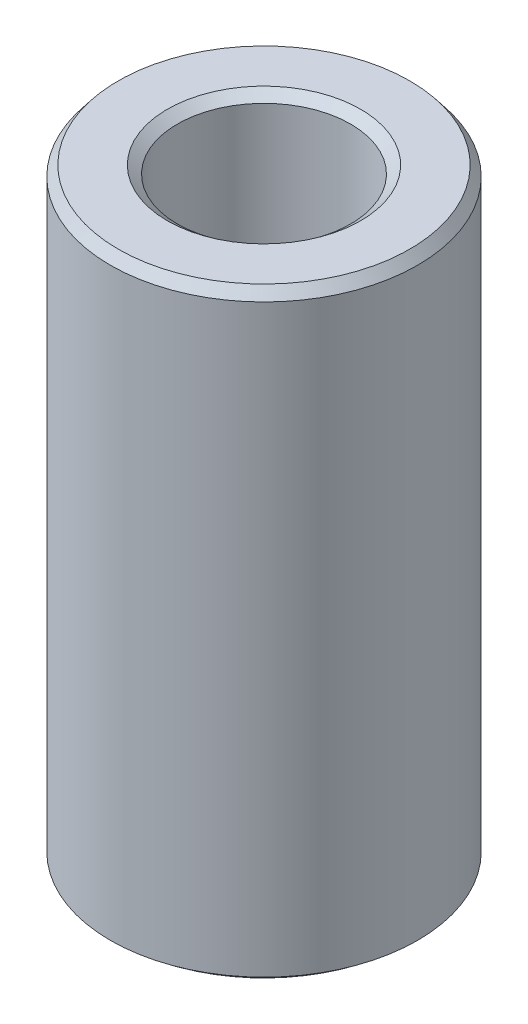
ISO-10303-21;
HEADER;
FILE_DESCRIPTION(('STEP AP214'),'2;1');
FILE_NAME('part.step','',(''),(''),'','','');
FILE_SCHEMA(('AUTOMOTIVE_DESIGN { 1 0 10303 214 1 1 1 1 }'));
ENDSEC;
DATA;
#1=APPLICATION_CONTEXT('core data for automotive mechanical design processes');
#2=APPLICATION_PROTOCOL_DEFINITION('international standard','automotive_design',2000,#1);
#3=PRODUCT_CONTEXT('',#1,'mechanical');
#4=PRODUCT('Part','Part','',(#3));
#5=PRODUCT_RELATED_PRODUCT_CATEGORY('part','',(#4));
#6=PRODUCT_DEFINITION_FORMATION('','',#4);
#7=PRODUCT_DEFINITION_CONTEXT('part definition',#1,'design');
#8=PRODUCT_DEFINITION('design','',#6,#7);
#9=PRODUCT_DEFINITION_SHAPE('','',#8);
#10=(LENGTH_UNIT() NAMED_UNIT(*) SI_UNIT(.MILLI.,.METRE.));
#11=(NAMED_UNIT(*) PLANE_ANGLE_UNIT() SI_UNIT($,.RADIAN.));
#12=(NAMED_UNIT(*) SI_UNIT($,.STERADIAN.) SOLID_ANGLE_UNIT());
#13=UNCERTAINTY_MEASURE_WITH_UNIT(LENGTH_MEASURE(1.E-05),#10,'distance_accuracy_value','');
#14=(GEOMETRIC_REPRESENTATION_CONTEXT(3) GLOBAL_UNCERTAINTY_ASSIGNED_CONTEXT((#13)) GLOBAL_UNIT_ASSIGNED_CONTEXT((#10,
#11,#12)) REPRESENTATION_CONTEXT('',''));
#15=CARTESIAN_POINT('',(0.,0.,0.));
#16=DIRECTION('',(0.,0.,1.));
#17=DIRECTION('',(1.,0.,0.));
#18=AXIS2_PLACEMENT_3D('',#15,#16,#17);
#19=CARTESIAN_POINT('',(0.,215.765966177956,0.));
#20=DIRECTION('',(0.,-1.,0.));
#21=DIRECTION('',(0.,0.,-1.));
#22=AXIS2_PLACEMENT_3D('',#19,#20,#21);
#23=CYLINDRICAL_SURFACE('',#22,55.);
#24=CARTESIAN_POINT('',(0.,2.80006320774273,0.));
#25=DIRECTION('',(0.,1.,0.));
#26=DIRECTION('',(0.,0.,1.));
#27=AXIS2_PLACEMENT_3D('',#24,#25,#26);
#28=CIRCLE('',#27,55.);
#29=CARTESIAN_POINT('',(0.,2.80006320774273,55.));
#30=VERTEX_POINT('',#29);
#31=EDGE_CURVE('E10',#30,#30,#28,.T.);
#32=ORIENTED_EDGE('',*,*,#31,.T.);
#33=EDGE_LOOP('',(#32));
#34=FACE_BOUND('',#33,.T.);
#35=CARTESIAN_POINT('',(0.,212.176720001309,0.));
#36=DIRECTION('',(0.,1.,0.));
#37=DIRECTION('',(0.,0.,1.));
#38=AXIS2_PLACEMENT_3D('',#35,#36,#37);
#39=CIRCLE('',#38,55.);
#40=CARTESIAN_POINT('',(0.,212.176720001309,55.));
#41=VERTEX_POINT('',#40);
#42=EDGE_CURVE('E50',#41,#41,#39,.F.);
#43=ORIENTED_EDGE('',*,*,#42,.T.);
#44=EDGE_LOOP('',(#43));
#45=FACE_BOUND('',#44,.T.);
#46=ADVANCED_FACE('F39',(#34,#45),#23,.T.);
#47=CARTESIAN_POINT('',(0.,215.765966177956,0.));
#48=DIRECTION('',(0.,1.,0.));
#49=DIRECTION('',(0.,0.,1.));
#50=AXIS2_PLACEMENT_3D('',#47,#48,#49);
#51=PLANE('',#50);
#52=CARTESIAN_POINT('',(0.,215.765966177956,0.));
#53=DIRECTION('',(0.,1.,0.));
#54=DIRECTION('',(0.,0.,1.));
#55=AXIS2_PLACEMENT_3D('',#52,#53,#54);
#56=CIRCLE('',#55,34.6072791589705);
#57=CARTESIAN_POINT('',(0.,215.765966177956,34.6072791589705));
#58=VERTEX_POINT('',#57);
#59=EDGE_CURVE('E58',#58,#58,#56,.F.);
#60=ORIENTED_EDGE('',*,*,#59,.T.);
#61=EDGE_LOOP('',(#60));
#62=FACE_BOUND('',#61,.T.);
#63=CARTESIAN_POINT('',(0.,215.765966177956,0.));
#64=DIRECTION('',(0.,1.,0.));
#65=DIRECTION('',(0.,0.,1.));
#66=AXIS2_PLACEMENT_3D('',#63,#64,#65);
#67=CIRCLE('',#66,52.1999367922572);
#68=CARTESIAN_POINT('',(0.,215.765966177956,52.1999367922572));
#69=VERTEX_POINT('',#68);
#70=EDGE_CURVE('E61',#69,#69,#67,.T.);
#71=ORIENTED_EDGE('',*,*,#70,.T.);
#72=EDGE_LOOP('',(#71));
#73=FACE_BOUND('',#72,.T.);
#74=ADVANCED_FACE('F88',(#62,#73),#51,.T.);
#75=CARTESIAN_POINT('',(0.,0.,0.));
#76=DIRECTION('',(0.,1.,0.));
#77=DIRECTION('',(0.,0.,1.));
#78=AXIS2_PLACEMENT_3D('',#75,#76,#77);
#79=PLANE('',#78);
#80=CARTESIAN_POINT('',(0.,0.,0.));
#81=DIRECTION('',(0.,1.,0.));
#82=DIRECTION('',(0.,0.,1.));
#83=AXIS2_PLACEMENT_3D('',#80,#81,#82);
#84=CIRCLE('',#83,33.8180961900667);
#85=CARTESIAN_POINT('',(0.,0.,-33.8180961900667));
#86=VERTEX_POINT('',#85);
#87=EDGE_CURVE('E51',#86,#86,#84,.T.);
#88=ORIENTED_EDGE('',*,*,#87,.T.);
#89=EDGE_LOOP('',(#88));
#90=FACE_BOUND('',#89,.T.);
#91=CARTESIAN_POINT('',(0.,0.,0.));
#92=DIRECTION('',(0.,1.,0.));
#93=DIRECTION('',(0.,0.,1.));
#94=AXIS2_PLACEMENT_3D('',#91,#92,#93);
#95=CIRCLE('',#94,51.4107538233534);
#96=CARTESIAN_POINT('',(0.,0.,51.4107538233534));
#97=VERTEX_POINT('',#96);
#98=EDGE_CURVE('E54',#97,#97,#95,.F.);
#99=ORIENTED_EDGE('',*,*,#98,.T.);
#100=EDGE_LOOP('',(#99));
#101=FACE_BOUND('',#100,.T.);
#102=ADVANCED_FACE('F83',(#90,#101),#79,.F.);
#103=CARTESIAN_POINT('',(0.,215.765966177956,0.));
#104=DIRECTION('',(0.,-1.,0.));
#105=DIRECTION('',(0.,0.,-1.));
#106=AXIS2_PLACEMENT_3D('',#103,#104,#105);
#107=CYLINDRICAL_SURFACE('',#106,31.0180329823239);
#108=CARTESIAN_POINT('',(0.,212.965902970213,0.));
#109=DIRECTION('',(0.,1.,0.));
#110=DIRECTION('',(0.,0.,1.));
#111=AXIS2_PLACEMENT_3D('',#108,#109,#110);
#112=CIRCLE('',#111,31.0180329823239);
#113=CARTESIAN_POINT('',(0.,212.965902970213,31.0180329823239));
#114=VERTEX_POINT('',#113);
#115=EDGE_CURVE('E67',#114,#114,#112,.T.);
#116=ORIENTED_EDGE('',*,*,#115,.T.);
#117=EDGE_LOOP('',(#116));
#118=FACE_BOUND('',#117,.T.);
#119=CARTESIAN_POINT('',(0.,3.58924617664666,0.));
#120=DIRECTION('',(0.,1.,0.));
#121=DIRECTION('',(0.,0.,1.));
#122=AXIS2_PLACEMENT_3D('',#119,#120,#121);
#123=CIRCLE('',#122,31.0180329823239);
#124=CARTESIAN_POINT('',(0.,3.58924617664666,-31.0180329823239));
#125=VERTEX_POINT('',#124);
#126=EDGE_CURVE('E69',#125,#125,#123,.F.);
#127=ORIENTED_EDGE('',*,*,#126,.T.);
#128=EDGE_LOOP('',(#127));
#129=FACE_BOUND('',#128,.T.);
#130=ADVANCED_FACE('F71',(#118,#129),#107,.F.);
#131=CARTESIAN_POINT('',(0.,212.965902970213,0.));
#132=DIRECTION('',(0.,1.,0.));
#133=DIRECTION('',(0.,0.,1.));
#134=AXIS2_PLACEMENT_3D('',#131,#132,#133);
#135=CONICAL_SURFACE('',#134,31.0180329823239,0.908291881763852);
#136=ORIENTED_EDGE('',*,*,#59,.F.);
#137=EDGE_LOOP('',(#136));
#138=FACE_BOUND('',#137,.T.);
#139=ORIENTED_EDGE('',*,*,#115,.F.);
#140=EDGE_LOOP('',(#139));
#141=FACE_BOUND('',#140,.T.);
#142=ADVANCED_FACE('F77',(#138,#141),#135,.F.);
#143=CARTESIAN_POINT('',(0.,0.,0.));
#144=DIRECTION('',(0.,-1.,0.));
#145=DIRECTION('',(0.,0.,-1.));
#146=AXIS2_PLACEMENT_3D('',#143,#144,#145);
#147=CONICAL_SURFACE('',#146,33.8180961900667,0.662504445031046);
#148=CARTESIAN_POINT('',(0.,3.58924617664666,-31.0180329823239));
#149=CARTESIAN_POINT('',(0.,3.55185819563992,-31.0472003074046));
#150=CARTESIAN_POINT('',(0.,3.51447021463319,-31.0763676324852));
#151=CARTESIAN_POINT('',(0.,3.43969425261972,-31.1347022826465));
#152=CARTESIAN_POINT('',(0.,3.40230627161298,-31.1638696077272));
#153=CARTESIAN_POINT('',(0.,3.32753030959951,-31.2222042578885));
#154=CARTESIAN_POINT('',(0.,3.29014232859277,-31.2513715829691));
#155=CARTESIAN_POINT('',(0.,3.2153663665793,-31.3097062331304));
#156=CARTESIAN_POINT('',(0.,3.17797838557256,-31.3388735582111));
#157=CARTESIAN_POINT('',(0.,3.10320242355909,-31.3972082083724));
#158=CARTESIAN_POINT('',(0.,3.06581444255236,-31.4263755334531));
#159=CARTESIAN_POINT('',(0.,2.99103848053888,-31.4847101836144));
#160=CARTESIAN_POINT('',(0.,2.95365049953215,-31.513877508695));
#161=CARTESIAN_POINT('',(0.,2.87887453751867,-31.5722121588563));
#162=CARTESIAN_POINT('',(0.,2.84148655651194,-31.601379483937));
#163=CARTESIAN_POINT('',(0.,2.76671059449847,-31.6597141340983));
#164=CARTESIAN_POINT('',(0.,2.72932261349173,-31.6888814591789));
#165=CARTESIAN_POINT('',(0.,2.65454665147826,-31.7472161093403));
#166=CARTESIAN_POINT('',(0.,2.61715867047152,-31.7763834344209));
#167=CARTESIAN_POINT('',(0.,2.54238270845805,-31.8347180845822));
#168=CARTESIAN_POINT('',(0.,2.50499472745131,-31.8638854096629));
#169=CARTESIAN_POINT('',(0.,2.43021876543784,-31.9222200598242));
#170=CARTESIAN_POINT('',(0.,2.39283078443111,-31.9513873849048));
#171=CARTESIAN_POINT('',(0.,2.31805482241763,-32.0097220350661));
#172=CARTESIAN_POINT('',(0.,2.2806668414109,-32.0388893601468));
#173=CARTESIAN_POINT('',(0.,2.20589087939743,-32.0972240103081));
#174=CARTESIAN_POINT('',(0.,2.16850289839069,-32.1263913353887));
#175=CARTESIAN_POINT('',(0.,2.09372693637722,-32.1847259855501));
#176=CARTESIAN_POINT('',(0.,2.05633895537048,-32.2138933106307));
#177=CARTESIAN_POINT('',(0.,1.98156299335701,-32.272227960792));
#178=CARTESIAN_POINT('',(0.,1.94417501235027,-32.3013952858727));
#179=CARTESIAN_POINT('',(0.,1.8693990503368,-32.359729936034));
#180=CARTESIAN_POINT('',(0.,1.83201106933007,-32.3888972611146));
#181=CARTESIAN_POINT('',(0.,1.75723510731659,-32.4472319112759));
#182=CARTESIAN_POINT('',(0.,1.71984712630986,-32.4763992363566));
#183=CARTESIAN_POINT('',(0.,1.64507116429639,-32.5347338865179));
#184=CARTESIAN_POINT('',(0.,1.60768318328965,-32.5639012115986));
#185=CARTESIAN_POINT('',(0.,1.53290722127618,-32.6222358617599));
#186=CARTESIAN_POINT('',(0.,1.49551924026944,-32.6514031868405));
#187=CARTESIAN_POINT('',(0.,1.42074327825597,-32.7097378370018));
#188=CARTESIAN_POINT('',(0.,1.38335529724923,-32.7389051620825));
#189=CARTESIAN_POINT('',(0.,1.30857933523576,-32.7972398122438));
#190=CARTESIAN_POINT('',(0.,1.27119135422903,-32.8264071373244));
#191=CARTESIAN_POINT('',(0.,1.19641539221555,-32.8847417874858));
#192=CARTESIAN_POINT('',(0.,1.15902741120882,-32.9139091125664));
#193=CARTESIAN_POINT('',(0.,1.08425144919534,-32.9722437627277));
#194=CARTESIAN_POINT('',(0.,1.04686346818861,-33.0014110878084));
#195=CARTESIAN_POINT('',(0.,0.972087506175137,-33.0597457379697));
#196=CARTESIAN_POINT('',(0.,0.934699525168401,-33.0889130630503));
#197=CARTESIAN_POINT('',(0.,0.85992356315493,-33.1472477132116));
#198=CARTESIAN_POINT('',(0.,0.822535582148193,-33.1764150382923));
#199=CARTESIAN_POINT('',(0.,0.747759620134721,-33.2347496884536));
#200=CARTESIAN_POINT('',(0.,0.710371639127985,-33.2639170135343));
#201=CARTESIAN_POINT('',(0.,0.635595677114513,-33.3222516636956));
#202=CARTESIAN_POINT('',(0.,0.598207696107776,-33.3514189887762));
#203=CARTESIAN_POINT('',(0.,0.523431734094305,-33.4097536389375));
#204=CARTESIAN_POINT('',(0.,0.486043753087569,-33.4389209640182));
#205=CARTESIAN_POINT('',(0.,0.411267791074096,-33.4972556141795));
#206=CARTESIAN_POINT('',(0.,0.37387981006736,-33.5264229392601));
#207=CARTESIAN_POINT('',(0.,0.299103848053888,-33.5847575894214));
#208=CARTESIAN_POINT('',(0.,0.261715867047153,-33.6139249145021));
#209=CARTESIAN_POINT('',(0.,0.186939905033681,-33.6722595646634));
#210=CARTESIAN_POINT('',(0.,0.149551924026945,-33.7014268897441));
#211=CARTESIAN_POINT('',(0.,0.0747759620134717,-33.7597615399054));
#212=CARTESIAN_POINT('',(0.,0.0373879810067353,-33.788928864986));
#213=CARTESIAN_POINT('',(0.,0.,-33.8180961900667));
#214=B_SPLINE_CURVE_WITH_KNOTS('',3,(#148,#149,#150,#151,#152,#153,#154,#155,#156,#157,#158,
#159,#160,#161,#162,#163,#164,#165,#166,#167,#168,#169,#170,#171,#172,#173,#174,#175,#176,#177,
#178,#179,#180,#181,#182,#183,#184,#185,#186,#187,#188,#189,#190,#191,#192,#193,#194,#195,#196,
#197,#198,#199,#200,#201,#202,#203,#204,#205,#206,#207,#208,#209,#210,#211,#212,#213),
.UNSPECIFIED.,.F.,.F.,(4,2,2,2,2,2,2,2,2,2,2,2,2,2,2,2,2,2,2,2,2,2,2,2,2,2,2,2,2,2,2,2,4),(0.,
0.14225802538024,0.284516050760483,0.426774076140726,0.569032101520966,0.711290126901207,
0.853548152281447,0.995806177661687,1.13806420304193,1.28032222842217,1.42258025380241,
1.56483827918265,1.70709630456289,1.84935432994313,1.99161235532338,2.13387038070362,
2.27612840608386,2.4183864314641,2.56064445684434,2.70290248222459,2.84516050760483,
2.98741853298507,3.12967655836531,3.27193458374555,3.41419260912579,3.55645063450603,
3.69870865988627,3.84096668526651,3.98322471064675,4.12548273602699,4.26774076140724,
4.40999878678748,4.55225681216772),.UNSPECIFIED.);
#215=EDGE_CURVE('BSEAM73',#125,#86,#214,.T.);
#216=ORIENTED_EDGE('',*,*,#126,.F.);
#217=ORIENTED_EDGE('',*,*,#87,.F.);
#218=ORIENTED_EDGE('',*,*,#215,.T.);
#219=ORIENTED_EDGE('',*,*,#215,.F.);
#220=EDGE_LOOP('',(#216,#218,#217,#219));
#221=FACE_BOUND('',#220,.T.);
#222=ADVANCED_FACE('F73',(#221),#147,.F.);
#223=CARTESIAN_POINT('',(0.,2.80006320774273,0.));
#224=DIRECTION('',(0.,1.,0.));
#225=DIRECTION('',(0.,0.,1.));
#226=AXIS2_PLACEMENT_3D('',#223,#224,#225);
#227=CONICAL_SURFACE('',#226,55.,0.90829188176385);
#228=ORIENTED_EDGE('',*,*,#98,.F.);
#229=EDGE_LOOP('',(#228));
#230=FACE_BOUND('',#229,.T.);
#231=ORIENTED_EDGE('',*,*,#31,.F.);
#232=EDGE_LOOP('',(#231));
#233=FACE_BOUND('',#232,.T.);
#234=ADVANCED_FACE('F76',(#230,#233),#227,.T.);
#235=CARTESIAN_POINT('',(0.,215.765966177956,0.));
#236=DIRECTION('',(0.,-1.,0.));
#237=DIRECTION('',(0.,0.,-1.));
#238=AXIS2_PLACEMENT_3D('',#235,#236,#237);
#239=CONICAL_SURFACE('',#238,52.1999367922572,0.662504445031046);
#240=ORIENTED_EDGE('',*,*,#42,.F.);
#241=EDGE_LOOP('',(#240));
#242=FACE_BOUND('',#241,.T.);
#243=ORIENTED_EDGE('',*,*,#70,.F.);
#244=EDGE_LOOP('',(#243));
#245=FACE_BOUND('',#244,.T.);
#246=ADVANCED_FACE('F45',(#242,#245),#239,.T.);
#247=CLOSED_SHELL('',(#46,#74,#102,#130,#142,#222,#234,#246));
#248=MANIFOLD_SOLID_BREP('B2',#247);
#249=ADVANCED_BREP_SHAPE_REPRESENTATION('',(#18,#248),#14);
#250=SHAPE_DEFINITION_REPRESENTATION(#9,#249);
ENDSEC;
END-ISO-10303-21;
